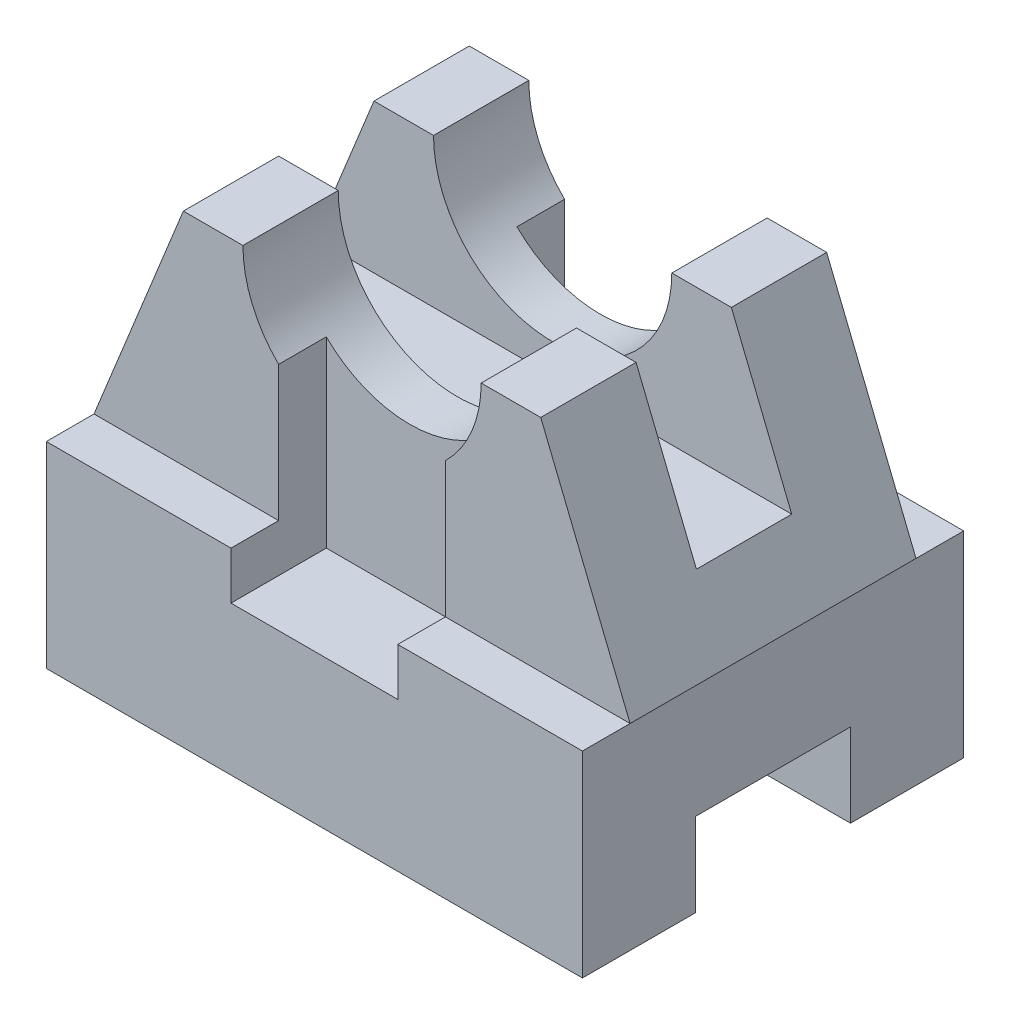
ISO-10303-21;
HEADER;
FILE_DESCRIPTION(('STEP AP214'),'2;1');
FILE_NAME('part.step','',(''),(''),'','','');
FILE_SCHEMA(('AUTOMOTIVE_DESIGN { 1 0 10303 214 1 1 1 1 }'));
ENDSEC;
DATA;
#1=APPLICATION_CONTEXT('core data for automotive mechanical design processes');
#2=APPLICATION_PROTOCOL_DEFINITION('international standard','automotive_design',2000,#1);
#3=PRODUCT_CONTEXT('',#1,'mechanical');
#4=PRODUCT('Part','Part','',(#3));
#5=PRODUCT_RELATED_PRODUCT_CATEGORY('part','',(#4));
#6=PRODUCT_DEFINITION_FORMATION('','',#4);
#7=PRODUCT_DEFINITION_CONTEXT('part definition',#1,'design');
#8=PRODUCT_DEFINITION('design','',#6,#7);
#9=PRODUCT_DEFINITION_SHAPE('','',#8);
#10=(LENGTH_UNIT() NAMED_UNIT(*) SI_UNIT(.MILLI.,.METRE.));
#11=(NAMED_UNIT(*) PLANE_ANGLE_UNIT() SI_UNIT($,.RADIAN.));
#12=(NAMED_UNIT(*) SI_UNIT($,.STERADIAN.) SOLID_ANGLE_UNIT());
#13=UNCERTAINTY_MEASURE_WITH_UNIT(LENGTH_MEASURE(1.E-05),#10,'distance_accuracy_value','');
#14=(GEOMETRIC_REPRESENTATION_CONTEXT(3) GLOBAL_UNCERTAINTY_ASSIGNED_CONTEXT((#13)) GLOBAL_UNIT_ASSIGNED_CONTEXT((#10,
#11,#12)) REPRESENTATION_CONTEXT('',''));
#15=CARTESIAN_POINT('',(0.,0.,0.));
#16=DIRECTION('',(0.,0.,1.));
#17=DIRECTION('',(1.,0.,0.));
#18=AXIS2_PLACEMENT_3D('',#15,#16,#17);
#19=CARTESIAN_POINT('',(-209.311684310067,33.,-56.));
#20=DIRECTION('',(0.,0.,-1.));
#21=DIRECTION('',(-1.,0.,0.));
#22=AXIS2_PLACEMENT_3D('',#19,#20,#21);
#23=PLANE('',#22);
#24=DIRECTION('',(0.,1.,0.));
#25=VECTOR('',#24,1.);
#26=CARTESIAN_POINT('',(-14.8720930232558,33.,-56.));
#27=LINE('',#26,#25);
#28=CARTESIAN_POINT('',(-14.8720930232558,33.,-56.));
#29=VERTEX_POINT('',#28);
#30=CARTESIAN_POINT('',(-14.8720930232558,55.7171431429143,-56.));
#31=VERTEX_POINT('',#30);
#32=EDGE_CURVE('E273',#29,#31,#27,.T.);
#33=ORIENTED_EDGE('',*,*,#32,.F.);
#34=DIRECTION('',(1.,0.,0.));
#35=VECTOR('',#34,1.);
#36=CARTESIAN_POINT('',(-209.311684310067,33.,-56.));
#37=LINE('',#36,#35);
#38=CARTESIAN_POINT('',(-45.8720930232558,33.,-55.9999999999999));
#39=VERTEX_POINT('',#38);
#40=EDGE_CURVE('E363',#39,#29,#37,.T.);
#41=ORIENTED_EDGE('',*,*,#40,.F.);
#42=DIRECTION('',(0.375705108739218,0.926739268223405,0.));
#43=VECTOR('',#42,1.);
#44=CARTESIAN_POINT('',(-68.9422988197003,-23.9065076312299,-56.));
#45=LINE('',#44,#43);
#46=CARTESIAN_POINT('',(-30.8720930232558,70.,-56.));
#47=VERTEX_POINT('',#46);
#48=EDGE_CURVE('E448',#39,#47,#45,.T.);
#49=ORIENTED_EDGE('',*,*,#48,.T.);
#50=DIRECTION('',(1.,0.,0.));
#51=VECTOR('',#50,1.);
#52=CARTESIAN_POINT('',(0.,70.,-56.));
#53=LINE('',#52,#51);
#54=CARTESIAN_POINT('',(-20.8720930232558,70.,-56.));
#55=VERTEX_POINT('',#54);
#56=EDGE_CURVE('E438',#47,#55,#53,.T.);
#57=ORIENTED_EDGE('',*,*,#56,.T.);
#58=CARTESIAN_POINT('',(-0.872093023255811,70.,-56.));
#59=DIRECTION('',(0.,0.,-1.));
#60=DIRECTION('',(-1.,0.,0.));
#61=AXIS2_PLACEMENT_3D('',#58,#59,#60);
#62=CIRCLE('',#61,20.);
#63=EDGE_CURVE('E444',#31,#55,#62,.T.);
#64=ORIENTED_EDGE('',*,*,#63,.F.);
#65=EDGE_LOOP('',(#33,#41,#49,#57,#64));
#66=FACE_BOUND('',#65,.T.);
#67=ADVANCED_FACE('F33',(#66),#23,.T.);
#68=CARTESIAN_POINT('',(-209.311684310067,33.,-64.));
#69=DIRECTION('',(0.,1.,0.));
#70=DIRECTION('',(0.,0.,1.));
#71=AXIS2_PLACEMENT_3D('',#68,#69,#70);
#72=PLANE('',#71);
#73=DIRECTION('',(0.,0.,1.));
#74=VECTOR('',#73,1.);
#75=CARTESIAN_POINT('',(-14.8720930232558,33.,-64.));
#76=LINE('',#75,#74);
#77=CARTESIAN_POINT('',(-14.8720930232558,33.,-64.));
#78=VERTEX_POINT('',#77);
#79=EDGE_CURVE('E275',#78,#29,#76,.T.);
#80=ORIENTED_EDGE('',*,*,#79,.F.);
#81=DIRECTION('',(-1.,0.,0.));
#82=VECTOR('',#81,1.);
#83=CARTESIAN_POINT('',(-45.8720930232558,33.,-64.));
#84=LINE('',#83,#82);
#85=CARTESIAN_POINT('',(-45.8720930232558,33.,-64.));
#86=VERTEX_POINT('',#85);
#87=EDGE_CURVE('E262',#78,#86,#84,.T.);
#88=ORIENTED_EDGE('',*,*,#87,.T.);
#89=DIRECTION('',(0.,0.,1.));
#90=VECTOR('',#89,1.);
#91=CARTESIAN_POINT('',(-45.8720930232558,33.,0.));
#92=LINE('',#91,#90);
#93=EDGE_CURVE('E369',#86,#39,#92,.T.);
#94=ORIENTED_EDGE('',*,*,#93,.T.);
#95=ORIENTED_EDGE('',*,*,#40,.T.);
#96=EDGE_LOOP('',(#80,#88,#94,#95));
#97=FACE_BOUND('',#96,.T.);
#98=ADVANCED_FACE('F546',(#97),#72,.T.);
#99=CARTESIAN_POINT('',(-0.872093023255811,70.,-56.));
#100=DIRECTION('',(0.,0.,1.));
#101=DIRECTION('',(1.,0.,0.));
#102=AXIS2_PLACEMENT_3D('',#99,#100,#101);
#103=CYLINDRICAL_SURFACE('',#102,20.);
#104=DIRECTION('',(0.,0.,1.));
#105=VECTOR('',#104,1.);
#106=CARTESIAN_POINT('',(-14.8720930232558,55.7171431429143,-56.));
#107=LINE('',#106,#105);
#108=CARTESIAN_POINT('',(-14.8720930232558,55.7171431429143,-16.));
#109=VERTEX_POINT('',#108);
#110=CARTESIAN_POINT('',(-14.8720930232558,55.7171431429143,-8.));
#111=VERTEX_POINT('',#110);
#112=EDGE_CURVE('E303',#109,#111,#107,.T.);
#113=ORIENTED_EDGE('',*,*,#112,.F.);
#114=CARTESIAN_POINT('',(-0.872093023255811,70.,-16.));
#115=DIRECTION('',(0.,0.,1.));
#116=DIRECTION('',(0.,-1.,0.));
#117=AXIS2_PLACEMENT_3D('',#114,#115,#116);
#118=CIRCLE('',#117,20.);
#119=CARTESIAN_POINT('',(13.1279069767442,55.7171431429143,-16.));
#120=VERTEX_POINT('',#119);
#121=EDGE_CURVE('E464',#120,#109,#118,.F.);
#122=ORIENTED_EDGE('',*,*,#121,.F.);
#123=DIRECTION('',(0.,0.,1.));
#124=VECTOR('',#123,1.);
#125=CARTESIAN_POINT('',(13.1279069767442,55.7171431429143,-56.));
#126=LINE('',#125,#124);
#127=CARTESIAN_POINT('',(13.1279069767442,55.7171431429143,-8.));
#128=VERTEX_POINT('',#127);
#129=EDGE_CURVE('E299',#128,#120,#126,.F.);
#130=ORIENTED_EDGE('',*,*,#129,.F.);
#131=CARTESIAN_POINT('',(-0.872093023255811,70.,-8.));
#132=DIRECTION('',(0.,0.,1.));
#133=DIRECTION('',(1.,0.,0.));
#134=AXIS2_PLACEMENT_3D('',#131,#132,#133);
#135=CIRCLE('',#134,20.);
#136=CARTESIAN_POINT('',(19.1279069767442,70.,-8.));
#137=VERTEX_POINT('',#136);
#138=EDGE_CURVE('E350',#128,#137,#135,.T.);
#139=ORIENTED_EDGE('',*,*,#138,.T.);
#140=DIRECTION('',(0.,0.,1.));
#141=VECTOR('',#140,1.);
#142=CARTESIAN_POINT('',(19.1279069767442,70.,-56.));
#143=LINE('',#142,#141);
#144=CARTESIAN_POINT('',(19.1279069767442,70.,-23.9999999999999));
#145=VERTEX_POINT('',#144);
#146=EDGE_CURVE('E358',#145,#137,#143,.T.);
#147=ORIENTED_EDGE('',*,*,#146,.F.);
#148=CARTESIAN_POINT('',(-0.872093023255811,70.,-23.9999999999999));
#149=DIRECTION('',(0.,0.,1.));
#150=DIRECTION('',(1.,0.,0.));
#151=AXIS2_PLACEMENT_3D('',#148,#149,#150);
#152=CIRCLE('',#151,20.);
#153=CARTESIAN_POINT('',(-20.8720930232558,70.,-23.9999999999999));
#154=VERTEX_POINT('',#153);
#155=EDGE_CURVE('E325',#145,#154,#152,.F.);
#156=ORIENTED_EDGE('',*,*,#155,.T.);
#157=DIRECTION('',(0.,0.,1.));
#158=VECTOR('',#157,1.);
#159=CARTESIAN_POINT('',(-20.8720930232558,70.,-56.));
#160=LINE('',#159,#158);
#161=CARTESIAN_POINT('',(-20.8720930232558,70.,-8.));
#162=VERTEX_POINT('',#161);
#163=EDGE_CURVE('E355',#162,#154,#160,.F.);
#164=ORIENTED_EDGE('',*,*,#163,.F.);
#165=EDGE_CURVE('E351',#162,#111,#135,.T.);
#166=ORIENTED_EDGE('',*,*,#165,.T.);
#167=EDGE_LOOP('',(#113,#122,#130,#139,#147,#156,#164,#166));
#168=FACE_BOUND('',#167,.T.);
#169=ADVANCED_FACE('F552',(#168),#103,.F.);
#170=CARTESIAN_POINT('',(-209.311684310067,33.,-8.));
#171=DIRECTION('',(0.,0.,-1.));
#172=DIRECTION('',(-1.,0.,0.));
#173=AXIS2_PLACEMENT_3D('',#170,#171,#172);
#174=PLANE('',#173);
#175=DIRECTION('',(0.,-1.,0.));
#176=VECTOR('',#175,1.);
#177=CARTESIAN_POINT('',(-14.8720930232558,33.,-8.));
#178=LINE('',#177,#176);
#179=CARTESIAN_POINT('',(-14.8720930232558,33.,-8.));
#180=VERTEX_POINT('',#179);
#181=EDGE_CURVE('E301',#111,#180,#178,.T.);
#182=ORIENTED_EDGE('',*,*,#181,.F.);
#183=ORIENTED_EDGE('',*,*,#165,.F.);
#184=DIRECTION('',(1.,0.,0.));
#185=VECTOR('',#184,1.);
#186=CARTESIAN_POINT('',(0.,70.,-8.));
#187=LINE('',#186,#185);
#188=CARTESIAN_POINT('',(-30.8720930232558,70.,-7.99999999999995));
#189=VERTEX_POINT('',#188);
#190=EDGE_CURVE('E432',#189,#162,#187,.T.);
#191=ORIENTED_EDGE('',*,*,#190,.F.);
#192=DIRECTION('',(0.375705108739218,0.926739268223405,0.));
#193=VECTOR('',#192,1.);
#194=CARTESIAN_POINT('',(-68.9422988197003,-23.9065076312299,-8.));
#195=LINE('',#194,#193);
#196=CARTESIAN_POINT('',(-45.8720930232558,33.,-7.99999999999995));
#197=VERTEX_POINT('',#196);
#198=EDGE_CURVE('E345',#197,#189,#195,.T.);
#199=ORIENTED_EDGE('',*,*,#198,.F.);
#200=DIRECTION('',(1.,0.,0.));
#201=VECTOR('',#200,1.);
#202=CARTESIAN_POINT('',(-209.311684310067,33.,-8.));
#203=LINE('',#202,#201);
#204=EDGE_CURVE('E373',#197,#180,#203,.T.);
#205=ORIENTED_EDGE('',*,*,#204,.T.);
#206=EDGE_LOOP('',(#182,#183,#191,#199,#205));
#207=FACE_BOUND('',#206,.T.);
#208=ADVANCED_FACE('F594',(#207),#174,.F.);
#209=DIRECTION('',(0.,1.,0.));
#210=VECTOR('',#209,1.);
#211=CARTESIAN_POINT('',(13.1279069767442,32.9999999999999,-8.));
#212=LINE('',#211,#210);
#213=CARTESIAN_POINT('',(13.1279069767442,33.,-8.));
#214=VERTEX_POINT('',#213);
#215=EDGE_CURVE('E297',#214,#128,#212,.T.);
#216=ORIENTED_EDGE('',*,*,#215,.F.);
#217=CARTESIAN_POINT('',(44.1279069767442,33.,-8.));
#218=VERTEX_POINT('',#217);
#219=EDGE_CURVE('E372',#214,#218,#203,.T.);
#220=ORIENTED_EDGE('',*,*,#219,.T.);
#221=DIRECTION('',(-0.375705108739218,0.926739268223405,0.));
#222=VECTOR('',#221,1.);
#223=CARTESIAN_POINT('',(8.3538115943525,121.2427686099,-8.));
#224=LINE('',#223,#222);
#225=CARTESIAN_POINT('',(29.1279069767442,70.,-8.00000000000001));
#226=VERTEX_POINT('',#225);
#227=EDGE_CURVE('E338',#218,#226,#224,.T.);
#228=ORIENTED_EDGE('',*,*,#227,.T.);
#229=EDGE_CURVE('E431',#137,#226,#187,.T.);
#230=ORIENTED_EDGE('',*,*,#229,.F.);
#231=ORIENTED_EDGE('',*,*,#138,.F.);
#232=EDGE_LOOP('',(#216,#220,#228,#230,#231));
#233=FACE_BOUND('',#232,.T.);
#234=ADVANCED_FACE('F631',(#233),#174,.F.);
#235=CARTESIAN_POINT('',(-45.8720930232558,70.,0.));
#236=DIRECTION('',(0.,0.,-1.));
#237=DIRECTION('',(-1.,0.,0.));
#238=AXIS2_PLACEMENT_3D('',#235,#236,#237);
#239=PLANE('',#238);
#240=DIRECTION('',(0.,1.,0.));
#241=VECTOR('',#240,1.);
#242=CARTESIAN_POINT('',(-14.8720930232558,25.,0.));
#243=LINE('',#242,#241);
#244=CARTESIAN_POINT('',(-14.8720930232558,25.,0.));
#245=VERTEX_POINT('',#244);
#246=CARTESIAN_POINT('',(-14.8720930232558,33.,0.));
#247=VERTEX_POINT('',#246);
#248=EDGE_CURVE('E287',#245,#247,#243,.T.);
#249=ORIENTED_EDGE('',*,*,#248,.T.);
#250=DIRECTION('',(1.,0.,0.));
#251=VECTOR('',#250,1.);
#252=CARTESIAN_POINT('',(-209.311684310067,33.,0.));
#253=LINE('',#252,#251);
#254=CARTESIAN_POINT('',(-45.8720930232558,33.,0.));
#255=VERTEX_POINT('',#254);
#256=EDGE_CURVE('E377',#255,#247,#253,.T.);
#257=ORIENTED_EDGE('',*,*,#256,.F.);
#258=DIRECTION('',(0.,-1.,0.));
#259=VECTOR('',#258,1.);
#260=CARTESIAN_POINT('',(-45.8720930232558,70.,0.));
#261=LINE('',#260,#259);
#262=CARTESIAN_POINT('',(-45.8720930232558,0.,0.));
#263=VERTEX_POINT('',#262);
#264=EDGE_CURVE('E429',#255,#263,#261,.T.);
#265=ORIENTED_EDGE('',*,*,#264,.T.);
#266=DIRECTION('',(1.,0.,0.));
#267=VECTOR('',#266,1.);
#268=CARTESIAN_POINT('',(-45.8720930232558,0.,0.));
#269=LINE('',#268,#267);
#270=CARTESIAN_POINT('',(44.1279069767442,0.,0.));
#271=VERTEX_POINT('',#270);
#272=EDGE_CURVE('E413',#263,#271,#269,.T.);
#273=ORIENTED_EDGE('',*,*,#272,.T.);
#274=DIRECTION('',(0.,-1.,0.));
#275=VECTOR('',#274,1.);
#276=CARTESIAN_POINT('',(44.1279069767442,70.,0.));
#277=LINE('',#276,#275);
#278=CARTESIAN_POINT('',(44.1279069767442,33.,0.));
#279=VERTEX_POINT('',#278);
#280=EDGE_CURVE('E427',#279,#271,#277,.T.);
#281=ORIENTED_EDGE('',*,*,#280,.F.);
#282=CARTESIAN_POINT('',(13.1279069767442,33.,0.));
#283=VERTEX_POINT('',#282);
#284=EDGE_CURVE('E376',#283,#279,#253,.T.);
#285=ORIENTED_EDGE('',*,*,#284,.F.);
#286=DIRECTION('',(0.,1.,0.));
#287=VECTOR('',#286,1.);
#288=CARTESIAN_POINT('',(13.1279069767442,25.,0.));
#289=LINE('',#288,#287);
#290=CARTESIAN_POINT('',(13.1279069767442,25.,0.));
#291=VERTEX_POINT('',#290);
#292=EDGE_CURVE('E56',#291,#283,#289,.T.);
#293=ORIENTED_EDGE('',*,*,#292,.F.);
#294=DIRECTION('',(-1.,0.,0.));
#295=VECTOR('',#294,1.);
#296=CARTESIAN_POINT('',(-14.8720930232558,25.,0.));
#297=LINE('',#296,#295);
#298=EDGE_CURVE('E284',#291,#245,#297,.T.);
#299=ORIENTED_EDGE('',*,*,#298,.T.);
#300=EDGE_LOOP('',(#249,#257,#265,#273,#281,#285,#293,#299));
#301=FACE_BOUND('',#300,.T.);
#302=ADVANCED_FACE('F501',(#301),#239,.F.);
#303=CARTESIAN_POINT('',(-209.311684310067,33.,0.));
#304=DIRECTION('',(0.,-1.,0.));
#305=DIRECTION('',(0.,0.,-1.));
#306=AXIS2_PLACEMENT_3D('',#303,#304,#305);
#307=PLANE('',#306);
#308=DIRECTION('',(0.,0.,1.));
#309=VECTOR('',#308,1.);
#310=CARTESIAN_POINT('',(-14.8720930232558,33.,0.));
#311=LINE('',#310,#309);
#312=EDGE_CURVE('E462',#180,#247,#311,.T.);
#313=ORIENTED_EDGE('',*,*,#312,.F.);
#314=ORIENTED_EDGE('',*,*,#204,.F.);
#315=DIRECTION('',(0.,0.,-1.));
#316=VECTOR('',#315,1.);
#317=CARTESIAN_POINT('',(-45.8720930232558,33.,0.));
#318=LINE('',#317,#316);
#319=EDGE_CURVE('E380',#255,#197,#318,.T.);
#320=ORIENTED_EDGE('',*,*,#319,.F.);
#321=ORIENTED_EDGE('',*,*,#256,.T.);
#322=EDGE_LOOP('',(#313,#314,#320,#321));
#323=FACE_BOUND('',#322,.T.);
#324=ADVANCED_FACE('F582',(#323),#307,.F.);
#325=DIRECTION('',(0.,0.,-1.));
#326=VECTOR('',#325,1.);
#327=CARTESIAN_POINT('',(13.1279069767442,33.,0.));
#328=LINE('',#327,#326);
#329=EDGE_CURVE('E460',#283,#214,#328,.T.);
#330=ORIENTED_EDGE('',*,*,#329,.F.);
#331=ORIENTED_EDGE('',*,*,#284,.T.);
#332=DIRECTION('',(0.,0.,1.));
#333=VECTOR('',#332,1.);
#334=CARTESIAN_POINT('',(44.1279069767442,33.,0.));
#335=LINE('',#334,#333);
#336=EDGE_CURVE('E434',#218,#279,#335,.T.);
#337=ORIENTED_EDGE('',*,*,#336,.F.);
#338=ORIENTED_EDGE('',*,*,#219,.F.);
#339=EDGE_LOOP('',(#330,#331,#337,#338));
#340=FACE_BOUND('',#339,.T.);
#341=ADVANCED_FACE('F498',(#340),#307,.F.);
#342=CARTESIAN_POINT('',(0.,70.,0.));
#343=DIRECTION('',(0.,-1.,0.));
#344=DIRECTION('',(0.,0.,-1.));
#345=AXIS2_PLACEMENT_3D('',#342,#343,#344);
#346=PLANE('',#345);
#347=ORIENTED_EDGE('',*,*,#163,.T.);
#348=DIRECTION('',(1.,0.,0.));
#349=VECTOR('',#348,1.);
#350=CARTESIAN_POINT('',(44.1279069767442,70.,-24.));
#351=LINE('',#350,#349);
#352=CARTESIAN_POINT('',(-30.8720930232558,70.,-23.9999999999999));
#353=VERTEX_POINT('',#352);
#354=EDGE_CURVE('E310',#353,#154,#351,.T.);
#355=ORIENTED_EDGE('',*,*,#354,.F.);
#356=DIRECTION('',(0.,0.,-1.));
#357=VECTOR('',#356,1.);
#358=CARTESIAN_POINT('',(-30.8720930232558,70.,215.439591286812));
#359=LINE('',#358,#357);
#360=EDGE_CURVE('E342',#189,#353,#359,.T.);
#361=ORIENTED_EDGE('',*,*,#360,.F.);
#362=ORIENTED_EDGE('',*,*,#190,.T.);
#363=EDGE_LOOP('',(#347,#355,#361,#362));
#364=FACE_BOUND('',#363,.T.);
#365=ADVANCED_FACE('F568',(#364),#346,.F.);
#366=DIRECTION('',(0.,0.,-1.));
#367=VECTOR('',#366,1.);
#368=CARTESIAN_POINT('',(29.1279069767442,70.,215.439591286811));
#369=LINE('',#368,#367);
#370=CARTESIAN_POINT('',(29.1279069767442,70.,-24.));
#371=VERTEX_POINT('',#370);
#372=EDGE_CURVE('E329',#226,#371,#369,.T.);
#373=ORIENTED_EDGE('',*,*,#372,.T.);
#374=EDGE_CURVE('E315',#145,#371,#351,.T.);
#375=ORIENTED_EDGE('',*,*,#374,.F.);
#376=ORIENTED_EDGE('',*,*,#146,.T.);
#377=ORIENTED_EDGE('',*,*,#229,.T.);
#378=EDGE_LOOP('',(#373,#375,#376,#377));
#379=FACE_BOUND('',#378,.T.);
#380=ADVANCED_FACE('F566',(#379),#346,.F.);
#381=CARTESIAN_POINT('',(-45.8720930232558,70.,0.));
#382=DIRECTION('',(1.,0.,0.));
#383=DIRECTION('',(0.,0.,-1.));
#384=AXIS2_PLACEMENT_3D('',#381,#382,#383);
#385=PLANE('',#384);
#386=DIRECTION('',(0.,0.,-1.));
#387=VECTOR('',#386,1.);
#388=CARTESIAN_POINT('',(-45.8720930232558,33.,215.439591286812));
#389=LINE('',#388,#387);
#390=EDGE_CURVE('E341',#197,#39,#389,.T.);
#391=ORIENTED_EDGE('',*,*,#390,.T.);
#392=ORIENTED_EDGE('',*,*,#93,.F.);
#393=DIRECTION('',(0.,-1.,0.));
#394=VECTOR('',#393,1.);
#395=CARTESIAN_POINT('',(-45.8720930232558,70.,-64.));
#396=LINE('',#395,#394);
#397=CARTESIAN_POINT('',(-45.8720930232558,0.,-64.));
#398=VERTEX_POINT('',#397);
#399=EDGE_CURVE('E423',#86,#398,#396,.T.);
#400=ORIENTED_EDGE('',*,*,#399,.T.);
#401=DIRECTION('',(0.,0.,1.));
#402=VECTOR('',#401,1.);
#403=CARTESIAN_POINT('',(-45.8720930232558,0.,0.));
#404=LINE('',#403,#402);
#405=CARTESIAN_POINT('',(-45.8720930232558,0.,-45.));
#406=VERTEX_POINT('',#405);
#407=EDGE_CURVE('E410',#398,#406,#404,.T.);
#408=ORIENTED_EDGE('',*,*,#407,.T.);
#409=DIRECTION('',(0.,-1.,0.));
#410=VECTOR('',#409,1.);
#411=CARTESIAN_POINT('',(-45.8720930232558,0.,-45.));
#412=LINE('',#411,#410);
#413=CARTESIAN_POINT('',(-45.8720930232558,14.,-45.));
#414=VERTEX_POINT('',#413);
#415=EDGE_CURVE('E383',#414,#406,#412,.T.);
#416=ORIENTED_EDGE('',*,*,#415,.F.);
#417=DIRECTION('',(0.,0.,-1.));
#418=VECTOR('',#417,1.);
#419=CARTESIAN_POINT('',(-45.8720930232558,14.,-45.));
#420=LINE('',#419,#418);
#421=CARTESIAN_POINT('',(-45.8720930232558,14.,-19.));
#422=VERTEX_POINT('',#421);
#423=EDGE_CURVE('E388',#422,#414,#420,.T.);
#424=ORIENTED_EDGE('',*,*,#423,.F.);
#425=DIRECTION('',(0.,1.,0.));
#426=VECTOR('',#425,1.);
#427=CARTESIAN_POINT('',(-45.8720930232558,0.,-19.));
#428=LINE('',#427,#426);
#429=CARTESIAN_POINT('',(-45.8720930232558,0.,-19.));
#430=VERTEX_POINT('',#429);
#431=EDGE_CURVE('E396',#430,#422,#428,.T.);
#432=ORIENTED_EDGE('',*,*,#431,.F.);
#433=EDGE_CURVE('E403',#430,#263,#404,.T.);
#434=ORIENTED_EDGE('',*,*,#433,.T.);
#435=ORIENTED_EDGE('',*,*,#264,.F.);
#436=ORIENTED_EDGE('',*,*,#319,.T.);
#437=EDGE_LOOP('',(#391,#392,#400,#408,#416,#424,#432,#434,#435,#436));
#438=FACE_BOUND('',#437,.T.);
#439=ADVANCED_FACE('F35',(#438),#385,.F.);
#440=CARTESIAN_POINT('',(-30.8720930232558,70.,-39.9999999999999));
#441=VERTEX_POINT('',#440);
#442=EDGE_CURVE('E346',#441,#47,#359,.T.);
#443=ORIENTED_EDGE('',*,*,#442,.F.);
#444=DIRECTION('',(-1.,0.,0.));
#445=VECTOR('',#444,1.);
#446=CARTESIAN_POINT('',(44.1279069767442,70.,-39.9999999999999));
#447=LINE('',#446,#445);
#448=CARTESIAN_POINT('',(-20.8720930232558,70.,-39.9999999999999));
#449=VERTEX_POINT('',#448);
#450=EDGE_CURVE('E305',#449,#441,#447,.T.);
#451=ORIENTED_EDGE('',*,*,#450,.F.);
#452=EDGE_CURVE('E354',#449,#55,#160,.F.);
#453=ORIENTED_EDGE('',*,*,#452,.T.);
#454=ORIENTED_EDGE('',*,*,#56,.F.);
#455=EDGE_LOOP('',(#443,#451,#453,#454));
#456=FACE_BOUND('',#455,.T.);
#457=ADVANCED_FACE('F559',(#456),#346,.F.);
#458=DIRECTION('',(0.,-1.,0.));
#459=VECTOR('',#458,1.);
#460=CARTESIAN_POINT('',(13.1279069767442,32.9999999999999,-56.));
#461=LINE('',#460,#459);
#462=CARTESIAN_POINT('',(13.1279069767442,55.7171431429143,-56.));
#463=VERTEX_POINT('',#462);
#464=CARTESIAN_POINT('',(13.1279069767442,33.,-56.));
#465=VERTEX_POINT('',#464);
#466=EDGE_CURVE('E263',#463,#465,#461,.T.);
#467=ORIENTED_EDGE('',*,*,#466,.F.);
#468=CARTESIAN_POINT('',(19.1279069767442,70.,-56.));
#469=VERTEX_POINT('',#468);
#470=EDGE_CURVE('E445',#469,#463,#62,.T.);
#471=ORIENTED_EDGE('',*,*,#470,.F.);
#472=CARTESIAN_POINT('',(29.1279069767442,70.,-56.));
#473=VERTEX_POINT('',#472);
#474=EDGE_CURVE('E437',#469,#473,#53,.T.);
#475=ORIENTED_EDGE('',*,*,#474,.T.);
#476=DIRECTION('',(-0.375705108739218,0.926739268223405,0.));
#477=VECTOR('',#476,1.);
#478=CARTESIAN_POINT('',(8.3538115943525,121.2427686099,-56.));
#479=LINE('',#478,#477);
#480=CARTESIAN_POINT('',(44.1279069767442,33.,-56.));
#481=VERTEX_POINT('',#480);
#482=EDGE_CURVE('E332',#481,#473,#479,.T.);
#483=ORIENTED_EDGE('',*,*,#482,.F.);
#484=EDGE_CURVE('E362',#465,#481,#37,.T.);
#485=ORIENTED_EDGE('',*,*,#484,.F.);
#486=EDGE_LOOP('',(#467,#471,#475,#483,#485));
#487=FACE_BOUND('',#486,.T.);
#488=ADVANCED_FACE('F479',(#487),#23,.T.);
#489=CARTESIAN_POINT('',(19.1279069767442,70.,-39.9999999999999));
#490=VERTEX_POINT('',#489);
#491=EDGE_CURVE('E359',#469,#490,#143,.T.);
#492=ORIENTED_EDGE('',*,*,#491,.T.);
#493=CARTESIAN_POINT('',(29.1279069767442,70.,-39.9999999999999));
#494=VERTEX_POINT('',#493);
#495=EDGE_CURVE('E314',#494,#490,#447,.T.);
#496=ORIENTED_EDGE('',*,*,#495,.F.);
#497=EDGE_CURVE('E333',#494,#473,#369,.T.);
#498=ORIENTED_EDGE('',*,*,#497,.T.);
#499=ORIENTED_EDGE('',*,*,#474,.F.);
#500=EDGE_LOOP('',(#492,#496,#498,#499));
#501=FACE_BOUND('',#500,.T.);
#502=ADVANCED_FACE('F558',(#501),#346,.F.);
#503=CARTESIAN_POINT('',(44.1279069767442,70.,0.));
#504=DIRECTION('',(-1.,0.,0.));
#505=DIRECTION('',(0.,0.,1.));
#506=AXIS2_PLACEMENT_3D('',#503,#504,#505);
#507=PLANE('',#506);
#508=DIRECTION('',(0.,0.,-1.));
#509=VECTOR('',#508,1.);
#510=CARTESIAN_POINT('',(44.1279069767442,33.,0.));
#511=LINE('',#510,#509);
#512=CARTESIAN_POINT('',(44.1279069767442,33.,-64.));
#513=VERTEX_POINT('',#512);
#514=EDGE_CURVE('E366',#481,#513,#511,.T.);
#515=ORIENTED_EDGE('',*,*,#514,.F.);
#516=DIRECTION('',(0.,0.,-1.));
#517=VECTOR('',#516,1.);
#518=CARTESIAN_POINT('',(44.1279069767442,33.,215.439591286811));
#519=LINE('',#518,#517);
#520=EDGE_CURVE('E328',#218,#481,#519,.T.);
#521=ORIENTED_EDGE('',*,*,#520,.F.);
#522=ORIENTED_EDGE('',*,*,#336,.T.);
#523=ORIENTED_EDGE('',*,*,#280,.T.);
#524=DIRECTION('',(0.,0.,-1.));
#525=VECTOR('',#524,1.);
#526=CARTESIAN_POINT('',(44.1279069767442,0.,0.));
#527=LINE('',#526,#525);
#528=CARTESIAN_POINT('',(44.1279069767442,0.,-19.));
#529=VERTEX_POINT('',#528);
#530=EDGE_CURVE('E417',#271,#529,#527,.T.);
#531=ORIENTED_EDGE('',*,*,#530,.T.);
#532=DIRECTION('',(0.,1.,0.));
#533=VECTOR('',#532,1.);
#534=CARTESIAN_POINT('',(44.1279069767442,0.,-19.));
#535=LINE('',#534,#533);
#536=CARTESIAN_POINT('',(44.1279069767442,14.,-19.));
#537=VERTEX_POINT('',#536);
#538=EDGE_CURVE('E387',#529,#537,#535,.T.);
#539=ORIENTED_EDGE('',*,*,#538,.T.);
#540=DIRECTION('',(0.,0.,-1.));
#541=VECTOR('',#540,1.);
#542=CARTESIAN_POINT('',(44.1279069767442,14.,-45.));
#543=LINE('',#542,#541);
#544=CARTESIAN_POINT('',(44.1279069767442,14.,-45.));
#545=VERTEX_POINT('',#544);
#546=EDGE_CURVE('E391',#537,#545,#543,.T.);
#547=ORIENTED_EDGE('',*,*,#546,.T.);
#548=DIRECTION('',(0.,-1.,0.));
#549=VECTOR('',#548,1.);
#550=CARTESIAN_POINT('',(44.1279069767442,0.,-45.));
#551=LINE('',#550,#549);
#552=CARTESIAN_POINT('',(44.1279069767442,0.,-45.));
#553=VERTEX_POINT('',#552);
#554=EDGE_CURVE('E384',#545,#553,#551,.T.);
#555=ORIENTED_EDGE('',*,*,#554,.T.);
#556=CARTESIAN_POINT('',(44.1279069767442,0.,-64.));
#557=VERTEX_POINT('',#556);
#558=EDGE_CURVE('E416',#553,#557,#527,.T.);
#559=ORIENTED_EDGE('',*,*,#558,.T.);
#560=DIRECTION('',(0.,-1.,0.));
#561=VECTOR('',#560,1.);
#562=CARTESIAN_POINT('',(44.1279069767442,70.,-64.));
#563=LINE('',#562,#561);
#564=EDGE_CURVE('E425',#513,#557,#563,.T.);
#565=ORIENTED_EDGE('',*,*,#564,.F.);
#566=EDGE_LOOP('',(#515,#521,#522,#523,#531,#539,#547,#555,#559,#565));
#567=FACE_BOUND('',#566,.T.);
#568=ADVANCED_FACE('F493',(#567),#507,.F.);
#569=CARTESIAN_POINT('',(-45.8720930232558,70.,-64.));
#570=DIRECTION('',(0.,0.,1.));
#571=DIRECTION('',(1.,0.,0.));
#572=AXIS2_PLACEMENT_3D('',#569,#570,#571);
#573=PLANE('',#572);
#574=ORIENTED_EDGE('',*,*,#87,.F.);
#575=DIRECTION('',(0.,1.,0.));
#576=VECTOR('',#575,1.);
#577=CARTESIAN_POINT('',(-14.8720930232558,25.,-64.));
#578=LINE('',#577,#576);
#579=CARTESIAN_POINT('',(-14.8720930232558,25.,-64.));
#580=VERTEX_POINT('',#579);
#581=EDGE_CURVE('E245',#580,#78,#578,.T.);
#582=ORIENTED_EDGE('',*,*,#581,.F.);
#583=DIRECTION('',(-1.,0.,0.));
#584=VECTOR('',#583,1.);
#585=CARTESIAN_POINT('',(-14.8720930232558,25.,-64.));
#586=LINE('',#585,#584);
#587=CARTESIAN_POINT('',(13.1279069767442,25.,-64.));
#588=VERTEX_POINT('',#587);
#589=EDGE_CURVE('E249',#588,#580,#586,.T.);
#590=ORIENTED_EDGE('',*,*,#589,.F.);
#591=DIRECTION('',(0.,1.,0.));
#592=VECTOR('',#591,1.);
#593=CARTESIAN_POINT('',(13.1279069767442,25.,-64.));
#594=LINE('',#593,#592);
#595=CARTESIAN_POINT('',(13.1279069767442,33.,-64.));
#596=VERTEX_POINT('',#595);
#597=EDGE_CURVE('E264',#588,#596,#594,.T.);
#598=ORIENTED_EDGE('',*,*,#597,.T.);
#599=EDGE_CURVE('E441',#513,#596,#84,.T.);
#600=ORIENTED_EDGE('',*,*,#599,.F.);
#601=ORIENTED_EDGE('',*,*,#564,.T.);
#602=DIRECTION('',(-1.,0.,0.));
#603=VECTOR('',#602,1.);
#604=CARTESIAN_POINT('',(-45.8720930232558,0.,-64.));
#605=LINE('',#604,#603);
#606=EDGE_CURVE('E420',#557,#398,#605,.T.);
#607=ORIENTED_EDGE('',*,*,#606,.T.);
#608=ORIENTED_EDGE('',*,*,#399,.F.);
#609=EDGE_LOOP('',(#574,#582,#590,#598,#600,#601,#607,#608));
#610=FACE_BOUND('',#609,.T.);
#611=ADVANCED_FACE('F260',(#610),#573,.F.);
#612=CARTESIAN_POINT('',(0.,0.,0.));
#613=DIRECTION('',(0.,-1.,0.));
#614=DIRECTION('',(0.,0.,-1.));
#615=AXIS2_PLACEMENT_3D('',#612,#613,#614);
#616=PLANE('',#615);
#617=DIRECTION('',(-1.,0.,0.));
#618=VECTOR('',#617,1.);
#619=CARTESIAN_POINT('',(44.1279069767442,0.,-45.));
#620=LINE('',#619,#618);
#621=EDGE_CURVE('E394',#553,#406,#620,.T.);
#622=ORIENTED_EDGE('',*,*,#621,.T.);
#623=ORIENTED_EDGE('',*,*,#407,.F.);
#624=ORIENTED_EDGE('',*,*,#606,.F.);
#625=ORIENTED_EDGE('',*,*,#558,.F.);
#626=EDGE_LOOP('',(#622,#623,#624,#625));
#627=FACE_BOUND('',#626,.T.);
#628=ADVANCED_FACE('F525',(#627),#616,.T.);
#629=DIRECTION('',(-1.,0.,0.));
#630=VECTOR('',#629,1.);
#631=CARTESIAN_POINT('',(44.1279069767442,0.,-19.));
#632=LINE('',#631,#630);
#633=EDGE_CURVE('E406',#529,#430,#632,.T.);
#634=ORIENTED_EDGE('',*,*,#633,.F.);
#635=ORIENTED_EDGE('',*,*,#530,.F.);
#636=ORIENTED_EDGE('',*,*,#272,.F.);
#637=ORIENTED_EDGE('',*,*,#433,.F.);
#638=EDGE_LOOP('',(#634,#635,#636,#637));
#639=FACE_BOUND('',#638,.T.);
#640=ADVANCED_FACE('F506',(#639),#616,.T.);
#641=CARTESIAN_POINT('',(44.1279069767442,0.,-45.));
#642=DIRECTION('',(0.,0.,-1.));
#643=DIRECTION('',(-1.,0.,0.));
#644=AXIS2_PLACEMENT_3D('',#641,#642,#643);
#645=PLANE('',#644);
#646=ORIENTED_EDGE('',*,*,#415,.T.);
#647=ORIENTED_EDGE('',*,*,#621,.F.);
#648=ORIENTED_EDGE('',*,*,#554,.F.);
#649=DIRECTION('',(-1.,0.,0.));
#650=VECTOR('',#649,1.);
#651=CARTESIAN_POINT('',(44.1279069767442,14.,-45.));
#652=LINE('',#651,#650);
#653=EDGE_CURVE('E401',#545,#414,#652,.T.);
#654=ORIENTED_EDGE('',*,*,#653,.T.);
#655=EDGE_LOOP('',(#646,#647,#648,#654));
#656=FACE_BOUND('',#655,.T.);
#657=ADVANCED_FACE('F674',(#656),#645,.F.);
#658=CARTESIAN_POINT('',(44.1279069767442,14.,-45.));
#659=DIRECTION('',(0.,1.,0.));
#660=DIRECTION('',(0.,0.,1.));
#661=AXIS2_PLACEMENT_3D('',#658,#659,#660);
#662=PLANE('',#661);
#663=ORIENTED_EDGE('',*,*,#423,.T.);
#664=ORIENTED_EDGE('',*,*,#653,.F.);
#665=ORIENTED_EDGE('',*,*,#546,.F.);
#666=DIRECTION('',(-1.,0.,0.));
#667=VECTOR('',#666,1.);
#668=CARTESIAN_POINT('',(44.1279069767442,14.,-19.));
#669=LINE('',#668,#667);
#670=EDGE_CURVE('E404',#537,#422,#669,.T.);
#671=ORIENTED_EDGE('',*,*,#670,.T.);
#672=EDGE_LOOP('',(#663,#664,#665,#671));
#673=FACE_BOUND('',#672,.T.);
#674=ADVANCED_FACE('F517',(#673),#662,.F.);
#675=CARTESIAN_POINT('',(44.1279069767442,0.,-19.));
#676=DIRECTION('',(0.,0.,1.));
#677=DIRECTION('',(1.,0.,0.));
#678=AXIS2_PLACEMENT_3D('',#675,#676,#677);
#679=PLANE('',#678);
#680=ORIENTED_EDGE('',*,*,#431,.T.);
#681=ORIENTED_EDGE('',*,*,#670,.F.);
#682=ORIENTED_EDGE('',*,*,#538,.F.);
#683=ORIENTED_EDGE('',*,*,#633,.T.);
#684=EDGE_LOOP('',(#680,#681,#682,#683));
#685=FACE_BOUND('',#684,.T.);
#686=ADVANCED_FACE('F511',(#685),#679,.F.);
#687=DIRECTION('',(0.,0.,-1.));
#688=VECTOR('',#687,1.);
#689=CARTESIAN_POINT('',(13.1279069767442,33.,-64.));
#690=LINE('',#689,#688);
#691=EDGE_CURVE('E266',#465,#596,#690,.T.);
#692=ORIENTED_EDGE('',*,*,#691,.F.);
#693=ORIENTED_EDGE('',*,*,#484,.T.);
#694=ORIENTED_EDGE('',*,*,#514,.T.);
#695=ORIENTED_EDGE('',*,*,#599,.T.);
#696=EDGE_LOOP('',(#692,#693,#694,#695));
#697=FACE_BOUND('',#696,.T.);
#698=ADVANCED_FACE('F485',(#697),#72,.T.);
#699=CARTESIAN_POINT('',(-0.872093023255811,70.,-48.));
#700=DIRECTION('',(0.,0.,1.));
#701=DIRECTION('',(0.,-1.,0.));
#702=AXIS2_PLACEMENT_3D('',#699,#700,#701);
#703=CIRCLE('',#702,20.);
#704=CARTESIAN_POINT('',(13.1279069767442,55.7171431429143,-48.));
#705=VERTEX_POINT('',#704);
#706=CARTESIAN_POINT('',(-14.8720930232558,55.7171431429143,-48.));
#707=VERTEX_POINT('',#706);
#708=EDGE_CURVE('E466',#705,#707,#703,.F.);
#709=ORIENTED_EDGE('',*,*,#708,.T.);
#710=DIRECTION('',(0.,0.,1.));
#711=VECTOR('',#710,1.);
#712=CARTESIAN_POINT('',(-14.8720930232558,55.7171431429143,-56.));
#713=LINE('',#712,#711);
#714=EDGE_CURVE('E11',#707,#31,#713,.F.);
#715=ORIENTED_EDGE('',*,*,#714,.T.);
#716=ORIENTED_EDGE('',*,*,#63,.T.);
#717=ORIENTED_EDGE('',*,*,#452,.F.);
#718=CARTESIAN_POINT('',(-0.872093023255811,70.,-39.9999999999999));
#719=DIRECTION('',(0.,0.,-1.));
#720=DIRECTION('',(-1.,0.,0.));
#721=AXIS2_PLACEMENT_3D('',#718,#719,#720);
#722=CIRCLE('',#721,20.);
#723=EDGE_CURVE('E320',#449,#490,#722,.F.);
#724=ORIENTED_EDGE('',*,*,#723,.T.);
#725=ORIENTED_EDGE('',*,*,#491,.F.);
#726=ORIENTED_EDGE('',*,*,#470,.T.);
#727=DIRECTION('',(0.,0.,1.));
#728=VECTOR('',#727,1.);
#729=CARTESIAN_POINT('',(13.1279069767442,55.7171431429143,-56.));
#730=LINE('',#729,#728);
#731=EDGE_CURVE('E41',#463,#705,#730,.T.);
#732=ORIENTED_EDGE('',*,*,#731,.T.);
#733=EDGE_LOOP('',(#709,#715,#716,#717,#724,#725,#726,#732));
#734=FACE_BOUND('',#733,.T.);
#735=ADVANCED_FACE('F470',(#734),#103,.F.);
#736=CARTESIAN_POINT('',(-45.8720930232558,33.,215.439591286812));
#737=DIRECTION('',(-0.926739268223405,0.375705108739218,0.));
#738=DIRECTION('',(-0.375705108739218,-0.926739268223405,0.));
#739=AXIS2_PLACEMENT_3D('',#736,#737,#738);
#740=PLANE('',#739);
#741=DIRECTION('',(0.375705108739218,0.926739268223405,0.));
#742=VECTOR('',#741,1.);
#743=CARTESIAN_POINT('',(-45.8720930232558,33.,-24.));
#744=LINE('',#743,#742);
#745=CARTESIAN_POINT('',(-41.0072281583909,45.,-23.9999999999999));
#746=VERTEX_POINT('',#745);
#747=EDGE_CURVE('E323',#746,#353,#744,.T.);
#748=ORIENTED_EDGE('',*,*,#747,.F.);
#749=DIRECTION('',(0.,0.,1.));
#750=VECTOR('',#749,1.);
#751=CARTESIAN_POINT('',(-41.0072281583909,45.,215.439591286812));
#752=LINE('',#751,#750);
#753=CARTESIAN_POINT('',(-41.0072281583909,45.,-39.9999999999999));
#754=VERTEX_POINT('',#753);
#755=EDGE_CURVE('E312',#754,#746,#752,.T.);
#756=ORIENTED_EDGE('',*,*,#755,.F.);
#757=DIRECTION('',(-0.375705108739218,-0.926739268223405,0.));
#758=VECTOR('',#757,1.);
#759=CARTESIAN_POINT('',(-45.8720930232558,33.,-39.9999999999999));
#760=LINE('',#759,#758);
#761=EDGE_CURVE('E318',#441,#754,#760,.T.);
#762=ORIENTED_EDGE('',*,*,#761,.F.);
#763=ORIENTED_EDGE('',*,*,#442,.T.);
#764=ORIENTED_EDGE('',*,*,#48,.F.);
#765=ORIENTED_EDGE('',*,*,#390,.F.);
#766=ORIENTED_EDGE('',*,*,#198,.T.);
#767=ORIENTED_EDGE('',*,*,#360,.T.);
#768=EDGE_LOOP('',(#748,#756,#762,#763,#764,#765,#766,#767));
#769=FACE_BOUND('',#768,.T.);
#770=ADVANCED_FACE('F616',(#769),#740,.T.);
#771=CARTESIAN_POINT('',(44.1279069767442,33.,215.439591286811));
#772=DIRECTION('',(-0.926739268223405,-0.375705108739217,0.));
#773=DIRECTION('',(0.375705108739218,-0.926739268223405,0.));
#774=AXIS2_PLACEMENT_3D('',#771,#772,#773);
#775=PLANE('',#774);
#776=DIRECTION('',(0.,0.,1.));
#777=VECTOR('',#776,1.);
#778=CARTESIAN_POINT('',(39.2630421118793,45.,215.439591286811));
#779=LINE('',#778,#777);
#780=CARTESIAN_POINT('',(39.2630421118793,45.,-39.9999999999999));
#781=VERTEX_POINT('',#780);
#782=CARTESIAN_POINT('',(39.2630421118793,45.,-23.9999999999999));
#783=VERTEX_POINT('',#782);
#784=EDGE_CURVE('E451',#781,#783,#779,.T.);
#785=ORIENTED_EDGE('',*,*,#784,.T.);
#786=DIRECTION('',(-0.375705108739217,0.926739268223405,0.));
#787=VECTOR('',#786,1.);
#788=CARTESIAN_POINT('',(44.1279069767442,33.,-23.9999999999999));
#789=LINE('',#788,#787);
#790=EDGE_CURVE('E457',#783,#371,#789,.T.);
#791=ORIENTED_EDGE('',*,*,#790,.T.);
#792=ORIENTED_EDGE('',*,*,#372,.F.);
#793=ORIENTED_EDGE('',*,*,#227,.F.);
#794=ORIENTED_EDGE('',*,*,#520,.T.);
#795=ORIENTED_EDGE('',*,*,#482,.T.);
#796=ORIENTED_EDGE('',*,*,#497,.F.);
#797=DIRECTION('',(0.375705108739217,-0.926739268223405,0.));
#798=VECTOR('',#797,1.);
#799=CARTESIAN_POINT('',(44.1279069767442,33.,-39.9999999999999));
#800=LINE('',#799,#798);
#801=EDGE_CURVE('E454',#494,#781,#800,.T.);
#802=ORIENTED_EDGE('',*,*,#801,.T.);
#803=EDGE_LOOP('',(#785,#791,#792,#793,#794,#795,#796,#802));
#804=FACE_BOUND('',#803,.T.);
#805=ADVANCED_FACE('F489',(#804),#775,.F.);
#806=CARTESIAN_POINT('',(44.1279069767442,45.,-24.));
#807=DIRECTION('',(0.,0.,1.));
#808=DIRECTION('',(1.,0.,0.));
#809=AXIS2_PLACEMENT_3D('',#806,#807,#808);
#810=PLANE('',#809);
#811=ORIENTED_EDGE('',*,*,#374,.T.);
#812=ORIENTED_EDGE('',*,*,#790,.F.);
#813=DIRECTION('',(1.,0.,0.));
#814=VECTOR('',#813,1.);
#815=CARTESIAN_POINT('',(44.1279069767442,45.,-24.));
#816=LINE('',#815,#814);
#817=EDGE_CURVE('E309',#746,#783,#816,.T.);
#818=ORIENTED_EDGE('',*,*,#817,.F.);
#819=ORIENTED_EDGE('',*,*,#747,.T.);
#820=ORIENTED_EDGE('',*,*,#354,.T.);
#821=ORIENTED_EDGE('',*,*,#155,.F.);
#822=EDGE_LOOP('',(#811,#812,#818,#819,#820,#821));
#823=FACE_BOUND('',#822,.T.);
#824=ADVANCED_FACE('F622',(#823),#810,.F.);
#825=CARTESIAN_POINT('',(44.1279069767442,45.,-39.9999999999999));
#826=DIRECTION('',(0.,0.,-1.));
#827=DIRECTION('',(-1.,0.,0.));
#828=AXIS2_PLACEMENT_3D('',#825,#826,#827);
#829=PLANE('',#828);
#830=ORIENTED_EDGE('',*,*,#450,.T.);
#831=ORIENTED_EDGE('',*,*,#761,.T.);
#832=DIRECTION('',(-1.,0.,0.));
#833=VECTOR('',#832,1.);
#834=CARTESIAN_POINT('',(44.1279069767442,45.,-39.9999999999999));
#835=LINE('',#834,#833);
#836=EDGE_CURVE('E306',#781,#754,#835,.T.);
#837=ORIENTED_EDGE('',*,*,#836,.F.);
#838=ORIENTED_EDGE('',*,*,#801,.F.);
#839=ORIENTED_EDGE('',*,*,#495,.T.);
#840=ORIENTED_EDGE('',*,*,#723,.F.);
#841=EDGE_LOOP('',(#830,#831,#837,#838,#839,#840));
#842=FACE_BOUND('',#841,.T.);
#843=ADVANCED_FACE('F612',(#842),#829,.F.);
#844=CARTESIAN_POINT('',(0.,45.,0.));
#845=DIRECTION('',(0.,-1.,0.));
#846=DIRECTION('',(1.,0.,0.));
#847=AXIS2_PLACEMENT_3D('',#844,#845,#846);
#848=PLANE('',#847);
#849=ORIENTED_EDGE('',*,*,#755,.T.);
#850=ORIENTED_EDGE('',*,*,#817,.T.);
#851=ORIENTED_EDGE('',*,*,#784,.F.);
#852=ORIENTED_EDGE('',*,*,#836,.T.);
#853=EDGE_LOOP('',(#849,#850,#851,#852));
#854=FACE_BOUND('',#853,.T.);
#855=ADVANCED_FACE('F619',(#854),#848,.F.);
#856=CARTESIAN_POINT('',(-14.8720930232558,25.,-16.));
#857=DIRECTION('',(0.,0.,1.));
#858=DIRECTION('',(0.,-1.,0.));
#859=AXIS2_PLACEMENT_3D('',#856,#857,#858);
#860=PLANE('',#859);
#861=ORIENTED_EDGE('',*,*,#121,.T.);
#862=DIRECTION('',(0.,1.,0.));
#863=VECTOR('',#862,1.);
#864=CARTESIAN_POINT('',(-14.8720930232558,25.,-16.));
#865=LINE('',#864,#863);
#866=CARTESIAN_POINT('',(-14.8720930232558,25.,-16.));
#867=VERTEX_POINT('',#866);
#868=EDGE_CURVE('E294',#867,#109,#865,.T.);
#869=ORIENTED_EDGE('',*,*,#868,.F.);
#870=DIRECTION('',(1.,0.,0.));
#871=VECTOR('',#870,1.);
#872=CARTESIAN_POINT('',(-14.8720930232558,25.,-16.));
#873=LINE('',#872,#871);
#874=CARTESIAN_POINT('',(13.1279069767442,25.,-16.));
#875=VERTEX_POINT('',#874);
#876=EDGE_CURVE('E280',#867,#875,#873,.T.);
#877=ORIENTED_EDGE('',*,*,#876,.T.);
#878=DIRECTION('',(0.,1.,0.));
#879=VECTOR('',#878,1.);
#880=CARTESIAN_POINT('',(13.1279069767442,25.,-16.));
#881=LINE('',#880,#879);
#882=EDGE_CURVE('E291',#875,#120,#881,.T.);
#883=ORIENTED_EDGE('',*,*,#882,.T.);
#884=EDGE_LOOP('',(#861,#869,#877,#883));
#885=FACE_BOUND('',#884,.T.);
#886=ADVANCED_FACE('F637',(#885),#860,.T.);
#887=CARTESIAN_POINT('',(-14.8720930232558,25.,0.));
#888=DIRECTION('',(1.,0.,0.));
#889=DIRECTION('',(0.,1.,0.));
#890=AXIS2_PLACEMENT_3D('',#887,#888,#889);
#891=PLANE('',#890);
#892=ORIENTED_EDGE('',*,*,#112,.T.);
#893=ORIENTED_EDGE('',*,*,#181,.T.);
#894=ORIENTED_EDGE('',*,*,#312,.T.);
#895=ORIENTED_EDGE('',*,*,#248,.F.);
#896=DIRECTION('',(0.,0.,-1.));
#897=VECTOR('',#896,1.);
#898=CARTESIAN_POINT('',(-14.8720930232558,25.,0.));
#899=LINE('',#898,#897);
#900=EDGE_CURVE('E277',#245,#867,#899,.T.);
#901=ORIENTED_EDGE('',*,*,#900,.T.);
#902=ORIENTED_EDGE('',*,*,#868,.T.);
#903=EDGE_LOOP('',(#892,#893,#894,#895,#901,#902));
#904=FACE_BOUND('',#903,.T.);
#905=ADVANCED_FACE('F599',(#904),#891,.T.);
#906=CARTESIAN_POINT('',(13.1279069767442,25.,0.));
#907=DIRECTION('',(-1.,0.,0.));
#908=DIRECTION('',(0.,-1.,0.));
#909=AXIS2_PLACEMENT_3D('',#906,#907,#908);
#910=PLANE('',#909);
#911=ORIENTED_EDGE('',*,*,#129,.T.);
#912=ORIENTED_EDGE('',*,*,#882,.F.);
#913=DIRECTION('',(0.,0.,1.));
#914=VECTOR('',#913,1.);
#915=CARTESIAN_POINT('',(13.1279069767442,25.,0.));
#916=LINE('',#915,#914);
#917=EDGE_CURVE('E282',#875,#291,#916,.T.);
#918=ORIENTED_EDGE('',*,*,#917,.T.);
#919=ORIENTED_EDGE('',*,*,#292,.T.);
#920=ORIENTED_EDGE('',*,*,#329,.T.);
#921=ORIENTED_EDGE('',*,*,#215,.T.);
#922=EDGE_LOOP('',(#911,#912,#918,#919,#920,#921));
#923=FACE_BOUND('',#922,.T.);
#924=ADVANCED_FACE('F540',(#923),#910,.T.);
#925=CARTESIAN_POINT('',(0.,25.,0.));
#926=DIRECTION('',(0.,-1.,0.));
#927=DIRECTION('',(0.,0.,-1.));
#928=AXIS2_PLACEMENT_3D('',#925,#926,#927);
#929=PLANE('',#928);
#930=ORIENTED_EDGE('',*,*,#900,.F.);
#931=ORIENTED_EDGE('',*,*,#298,.F.);
#932=ORIENTED_EDGE('',*,*,#917,.F.);
#933=ORIENTED_EDGE('',*,*,#876,.F.);
#934=EDGE_LOOP('',(#930,#931,#932,#933));
#935=FACE_BOUND('',#934,.T.);
#936=ADVANCED_FACE('F533',(#935),#929,.F.);
#937=CARTESIAN_POINT('',(-14.8720930232558,25.,-48.));
#938=DIRECTION('',(0.,0.,1.));
#939=DIRECTION('',(0.,-1.,0.));
#940=AXIS2_PLACEMENT_3D('',#937,#938,#939);
#941=PLANE('',#940);
#942=DIRECTION('',(0.,1.,0.));
#943=VECTOR('',#942,1.);
#944=CARTESIAN_POINT('',(13.1279069767442,25.,-48.));
#945=LINE('',#944,#943);
#946=CARTESIAN_POINT('',(13.1279069767442,25.,-48.));
#947=VERTEX_POINT('',#946);
#948=EDGE_CURVE('E268',#947,#705,#945,.T.);
#949=ORIENTED_EDGE('',*,*,#948,.F.);
#950=DIRECTION('',(1.,0.,0.));
#951=VECTOR('',#950,1.);
#952=CARTESIAN_POINT('',(-14.8720930232558,25.,-48.));
#953=LINE('',#952,#951);
#954=CARTESIAN_POINT('',(-14.8720930232558,25.,-48.));
#955=VERTEX_POINT('',#954);
#956=EDGE_CURVE('E527',#955,#947,#953,.T.);
#957=ORIENTED_EDGE('',*,*,#956,.F.);
#958=DIRECTION('',(0.,1.,0.));
#959=VECTOR('',#958,1.);
#960=CARTESIAN_POINT('',(-14.8720930232558,25.,-48.));
#961=LINE('',#960,#959);
#962=EDGE_CURVE('E48',#955,#707,#961,.T.);
#963=ORIENTED_EDGE('',*,*,#962,.T.);
#964=ORIENTED_EDGE('',*,*,#708,.F.);
#965=EDGE_LOOP('',(#949,#957,#963,#964));
#966=FACE_BOUND('',#965,.T.);
#967=ADVANCED_FACE('F531',(#966),#941,.F.);
#968=CARTESIAN_POINT('',(-14.8720930232558,25.,-64.));
#969=DIRECTION('',(-1.,0.,0.));
#970=DIRECTION('',(0.,-1.,0.));
#971=AXIS2_PLACEMENT_3D('',#968,#969,#970);
#972=PLANE('',#971);
#973=ORIENTED_EDGE('',*,*,#79,.T.);
#974=ORIENTED_EDGE('',*,*,#32,.T.);
#975=ORIENTED_EDGE('',*,*,#714,.F.);
#976=ORIENTED_EDGE('',*,*,#962,.F.);
#977=DIRECTION('',(0.,0.,1.));
#978=VECTOR('',#977,1.);
#979=CARTESIAN_POINT('',(-14.8720930232558,25.,-64.));
#980=LINE('',#979,#978);
#981=EDGE_CURVE('E241',#580,#955,#980,.T.);
#982=ORIENTED_EDGE('',*,*,#981,.F.);
#983=ORIENTED_EDGE('',*,*,#581,.T.);
#984=EDGE_LOOP('',(#973,#974,#975,#976,#982,#983));
#985=FACE_BOUND('',#984,.T.);
#986=ADVANCED_FACE('F243',(#985),#972,.F.);
#987=CARTESIAN_POINT('',(13.1279069767442,25.,-64.));
#988=DIRECTION('',(1.,0.,0.));
#989=DIRECTION('',(0.,1.,0.));
#990=AXIS2_PLACEMENT_3D('',#987,#988,#989);
#991=PLANE('',#990);
#992=ORIENTED_EDGE('',*,*,#691,.T.);
#993=ORIENTED_EDGE('',*,*,#597,.F.);
#994=DIRECTION('',(0.,0.,-1.));
#995=VECTOR('',#994,1.);
#996=CARTESIAN_POINT('',(13.1279069767442,25.,-64.));
#997=LINE('',#996,#995);
#998=EDGE_CURVE('E255',#947,#588,#997,.T.);
#999=ORIENTED_EDGE('',*,*,#998,.F.);
#1000=ORIENTED_EDGE('',*,*,#948,.T.);
#1001=ORIENTED_EDGE('',*,*,#731,.F.);
#1002=ORIENTED_EDGE('',*,*,#466,.T.);
#1003=EDGE_LOOP('',(#992,#993,#999,#1000,#1001,#1002));
#1004=FACE_BOUND('',#1003,.T.);
#1005=ADVANCED_FACE('F475',(#1004),#991,.F.);
#1006=CARTESIAN_POINT('',(0.,25.,-64.));
#1007=DIRECTION('',(0.,-1.,0.));
#1008=DIRECTION('',(0.,0.,1.));
#1009=AXIS2_PLACEMENT_3D('',#1006,#1007,#1008);
#1010=PLANE('',#1009);
#1011=ORIENTED_EDGE('',*,*,#981,.T.);
#1012=ORIENTED_EDGE('',*,*,#956,.T.);
#1013=ORIENTED_EDGE('',*,*,#998,.T.);
#1014=ORIENTED_EDGE('',*,*,#589,.T.);
#1015=EDGE_LOOP('',(#1011,#1012,#1013,#1014));
#1016=FACE_BOUND('',#1015,.T.);
#1017=ADVANCED_FACE('F253',(#1016),#1010,.F.);
#1018=CLOSED_SHELL('',(#67,#98,#169,#208,#234,#302,#324,#341,#365,#380,#439,#457,#488,#502,#568,
#611,#628,#640,#657,#674,#686,#698,#735,#770,#805,#824,#843,#855,#886,#905,#924,#936,#967,#986,
#1005,#1017));
#1019=MANIFOLD_SOLID_BREP('B2',#1018);
#1020=ADVANCED_BREP_SHAPE_REPRESENTATION('',(#18,#1019),#14);
#1021=SHAPE_DEFINITION_REPRESENTATION(#9,#1020);
ENDSEC;
END-ISO-10303-21;
